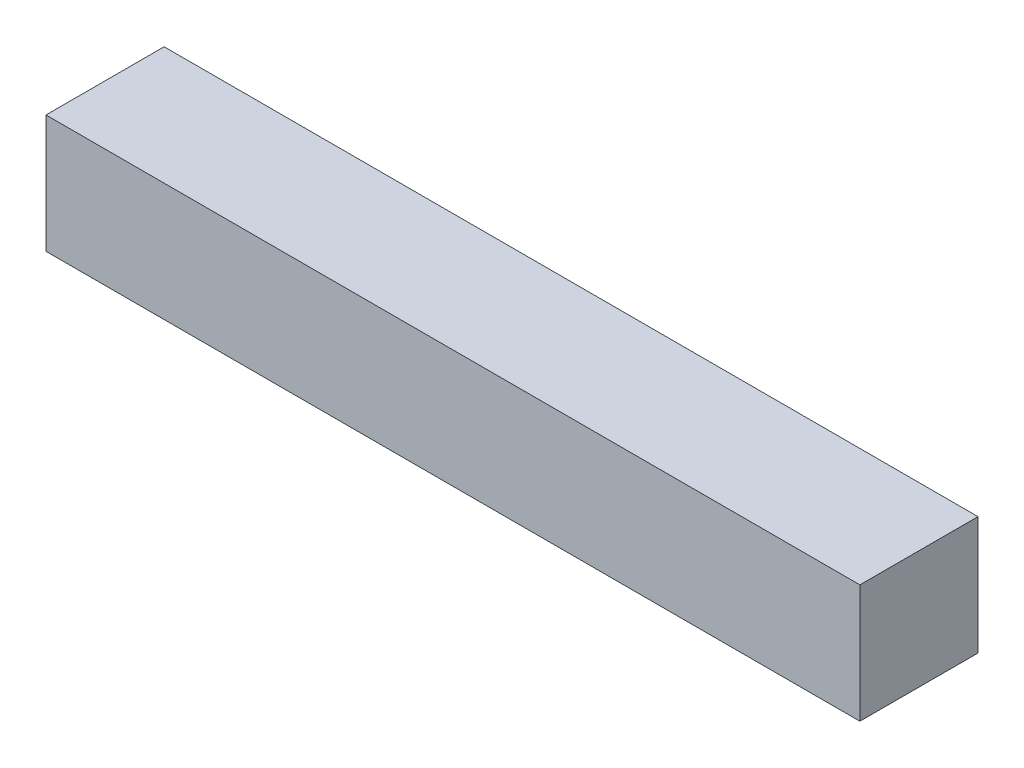
ISO-10303-21;
HEADER;
FILE_DESCRIPTION(('STEP AP214'),'2;1');
FILE_NAME('part.step','',(''),(''),'','','');
FILE_SCHEMA(('AUTOMOTIVE_DESIGN { 1 0 10303 214 1 1 1 1 }'));
ENDSEC;
DATA;
#1=APPLICATION_CONTEXT('core data for automotive mechanical design processes');
#2=APPLICATION_PROTOCOL_DEFINITION('international standard','automotive_design',2000,#1);
#3=PRODUCT_CONTEXT('',#1,'mechanical');
#4=PRODUCT('Part','Part','',(#3));
#5=PRODUCT_RELATED_PRODUCT_CATEGORY('part','',(#4));
#6=PRODUCT_DEFINITION_FORMATION('','',#4);
#7=PRODUCT_DEFINITION_CONTEXT('part definition',#1,'design');
#8=PRODUCT_DEFINITION('design','',#6,#7);
#9=PRODUCT_DEFINITION_SHAPE('','',#8);
#10=(LENGTH_UNIT() NAMED_UNIT(*) SI_UNIT(.MILLI.,.METRE.));
#11=(NAMED_UNIT(*) PLANE_ANGLE_UNIT() SI_UNIT($,.RADIAN.));
#12=(NAMED_UNIT(*) SI_UNIT($,.STERADIAN.) SOLID_ANGLE_UNIT());
#13=UNCERTAINTY_MEASURE_WITH_UNIT(LENGTH_MEASURE(1.E-05),#10,'distance_accuracy_value','');
#14=(GEOMETRIC_REPRESENTATION_CONTEXT(3) GLOBAL_UNCERTAINTY_ASSIGNED_CONTEXT((#13)) GLOBAL_UNIT_ASSIGNED_CONTEXT((#10,
#11,#12)) REPRESENTATION_CONTEXT('',''));
#15=CARTESIAN_POINT('',(0.,0.,0.));
#16=DIRECTION('',(0.,0.,1.));
#17=DIRECTION('',(1.,0.,0.));
#18=AXIS2_PLACEMENT_3D('',#15,#16,#17);
#19=CARTESIAN_POINT('',(-175.,0.,50.8));
#20=DIRECTION('',(1.,0.,0.));
#21=DIRECTION('',(0.,0.,-1.));
#22=AXIS2_PLACEMENT_3D('',#19,#20,#21);
#23=PLANE('',#22);
#24=DIRECTION('',(0.,-1.,0.));
#25=VECTOR('',#24,1.);
#26=CARTESIAN_POINT('',(-175.,0.,0.));
#27=LINE('',#26,#25);
#28=CARTESIAN_POINT('',(-175.,25.4,0.));
#29=VERTEX_POINT('',#28);
#30=CARTESIAN_POINT('',(-175.,-25.4,0.));
#31=VERTEX_POINT('',#30);
#32=EDGE_CURVE('E98',#29,#31,#27,.T.);
#33=ORIENTED_EDGE('',*,*,#32,.T.);
#34=DIRECTION('',(0.,0.,-1.));
#35=VECTOR('',#34,1.);
#36=CARTESIAN_POINT('',(-175.,-25.4,50.8));
#37=LINE('',#36,#35);
#38=CARTESIAN_POINT('',(-175.,-25.4,50.8));
#39=VERTEX_POINT('',#38);
#40=EDGE_CURVE('E11',#39,#31,#37,.T.);
#41=ORIENTED_EDGE('',*,*,#40,.F.);
#42=DIRECTION('',(0.,-1.,0.));
#43=VECTOR('',#42,1.);
#44=CARTESIAN_POINT('',(-175.,0.,50.8));
#45=LINE('',#44,#43);
#46=CARTESIAN_POINT('',(-175.,25.4,50.8));
#47=VERTEX_POINT('',#46);
#48=EDGE_CURVE('E84',#47,#39,#45,.T.);
#49=ORIENTED_EDGE('',*,*,#48,.F.);
#50=DIRECTION('',(0.,0.,-1.));
#51=VECTOR('',#50,1.);
#52=CARTESIAN_POINT('',(-175.,25.4,50.8));
#53=LINE('',#52,#51);
#54=EDGE_CURVE('E51',#47,#29,#53,.T.);
#55=ORIENTED_EDGE('',*,*,#54,.T.);
#56=EDGE_LOOP('',(#33,#41,#49,#55));
#57=FACE_BOUND('',#56,.T.);
#58=ADVANCED_FACE('F35',(#57),#23,.F.);
#59=CARTESIAN_POINT('',(0.,-25.4,50.8));
#60=DIRECTION('',(0.,1.,0.));
#61=DIRECTION('',(-1.,0.,0.));
#62=AXIS2_PLACEMENT_3D('',#59,#60,#61);
#63=PLANE('',#62);
#64=DIRECTION('',(1.,0.,0.));
#65=VECTOR('',#64,1.);
#66=CARTESIAN_POINT('',(0.,-25.4,0.));
#67=LINE('',#66,#65);
#68=CARTESIAN_POINT('',(175.,-25.4,0.));
#69=VERTEX_POINT('',#68);
#70=EDGE_CURVE('E89',#31,#69,#67,.T.);
#71=ORIENTED_EDGE('',*,*,#70,.T.);
#72=DIRECTION('',(0.,0.,-1.));
#73=VECTOR('',#72,1.);
#74=CARTESIAN_POINT('',(175.,-25.4,50.8));
#75=LINE('',#74,#73);
#76=CARTESIAN_POINT('',(175.,-25.4,50.8));
#77=VERTEX_POINT('',#76);
#78=EDGE_CURVE('E43',#77,#69,#75,.T.);
#79=ORIENTED_EDGE('',*,*,#78,.F.);
#80=DIRECTION('',(1.,0.,0.));
#81=VECTOR('',#80,1.);
#82=CARTESIAN_POINT('',(0.,-25.4,50.8));
#83=LINE('',#82,#81);
#84=EDGE_CURVE('E77',#39,#77,#83,.T.);
#85=ORIENTED_EDGE('',*,*,#84,.F.);
#86=ORIENTED_EDGE('',*,*,#40,.T.);
#87=EDGE_LOOP('',(#71,#79,#85,#86));
#88=FACE_BOUND('',#87,.T.);
#89=ADVANCED_FACE('F88',(#88),#63,.F.);
#90=CARTESIAN_POINT('',(175.,0.,50.8));
#91=DIRECTION('',(-1.,0.,0.));
#92=DIRECTION('',(0.,0.,1.));
#93=AXIS2_PLACEMENT_3D('',#90,#91,#92);
#94=PLANE('',#93);
#95=DIRECTION('',(0.,1.,0.));
#96=VECTOR('',#95,1.);
#97=CARTESIAN_POINT('',(175.,0.,0.));
#98=LINE('',#97,#96);
#99=CARTESIAN_POINT('',(175.,25.4,0.));
#100=VERTEX_POINT('',#99);
#101=EDGE_CURVE('E101',#69,#100,#98,.T.);
#102=ORIENTED_EDGE('',*,*,#101,.T.);
#103=DIRECTION('',(0.,0.,-1.));
#104=VECTOR('',#103,1.);
#105=CARTESIAN_POINT('',(175.,25.4,50.8));
#106=LINE('',#105,#104);
#107=CARTESIAN_POINT('',(175.,25.4,50.8));
#108=VERTEX_POINT('',#107);
#109=EDGE_CURVE('E66',#108,#100,#106,.T.);
#110=ORIENTED_EDGE('',*,*,#109,.F.);
#111=DIRECTION('',(0.,1.,0.));
#112=VECTOR('',#111,1.);
#113=CARTESIAN_POINT('',(175.,0.,50.8));
#114=LINE('',#113,#112);
#115=EDGE_CURVE('E83',#77,#108,#114,.T.);
#116=ORIENTED_EDGE('',*,*,#115,.F.);
#117=ORIENTED_EDGE('',*,*,#78,.T.);
#118=EDGE_LOOP('',(#102,#110,#116,#117));
#119=FACE_BOUND('',#118,.T.);
#120=ADVANCED_FACE('F92',(#119),#94,.F.);
#121=CARTESIAN_POINT('',(0.,25.4,50.8));
#122=DIRECTION('',(0.,1.,0.));
#123=DIRECTION('',(0.,0.,1.));
#124=AXIS2_PLACEMENT_3D('',#121,#122,#123);
#125=PLANE('',#124);
#126=DIRECTION('',(1.,0.,0.));
#127=VECTOR('',#126,1.);
#128=CARTESIAN_POINT('',(0.,25.4,0.));
#129=LINE('',#128,#127);
#130=EDGE_CURVE('E103',#29,#100,#129,.T.);
#131=ORIENTED_EDGE('',*,*,#130,.F.);
#132=ORIENTED_EDGE('',*,*,#54,.F.);
#133=DIRECTION('',(1.,0.,0.));
#134=VECTOR('',#133,1.);
#135=CARTESIAN_POINT('',(0.,25.4,50.8));
#136=LINE('',#135,#134);
#137=EDGE_CURVE('E93',#47,#108,#136,.T.);
#138=ORIENTED_EDGE('',*,*,#137,.T.);
#139=ORIENTED_EDGE('',*,*,#109,.T.);
#140=EDGE_LOOP('',(#131,#132,#138,#139));
#141=FACE_BOUND('',#140,.T.);
#142=ADVANCED_FACE('F109',(#141),#125,.T.);
#143=CARTESIAN_POINT('',(0.,0.,50.8));
#144=DIRECTION('',(0.,0.,1.));
#145=DIRECTION('',(1.,0.,0.));
#146=AXIS2_PLACEMENT_3D('',#143,#144,#145);
#147=PLANE('',#146);
#148=ORIENTED_EDGE('',*,*,#48,.T.);
#149=ORIENTED_EDGE('',*,*,#84,.T.);
#150=ORIENTED_EDGE('',*,*,#115,.T.);
#151=ORIENTED_EDGE('',*,*,#137,.F.);
#152=EDGE_LOOP('',(#148,#149,#150,#151));
#153=FACE_BOUND('',#152,.T.);
#154=ADVANCED_FACE('F80',(#153),#147,.T.);
#155=CARTESIAN_POINT('',(0.,0.,0.));
#156=DIRECTION('',(0.,0.,1.));
#157=DIRECTION('',(1.,0.,0.));
#158=AXIS2_PLACEMENT_3D('',#155,#156,#157);
#159=PLANE('',#158);
#160=ORIENTED_EDGE('',*,*,#32,.F.);
#161=ORIENTED_EDGE('',*,*,#130,.T.);
#162=ORIENTED_EDGE('',*,*,#101,.F.);
#163=ORIENTED_EDGE('',*,*,#70,.F.);
#164=EDGE_LOOP('',(#160,#161,#162,#163));
#165=FACE_BOUND('',#164,.T.);
#166=ADVANCED_FACE('F108',(#165),#159,.F.);
#167=CLOSED_SHELL('',(#58,#89,#120,#142,#154,#166));
#168=MANIFOLD_SOLID_BREP('B2',#167);
#169=ADVANCED_BREP_SHAPE_REPRESENTATION('',(#18,#168),#14);
#170=SHAPE_DEFINITION_REPRESENTATION(#9,#169);
ENDSEC;
END-ISO-10303-21;
